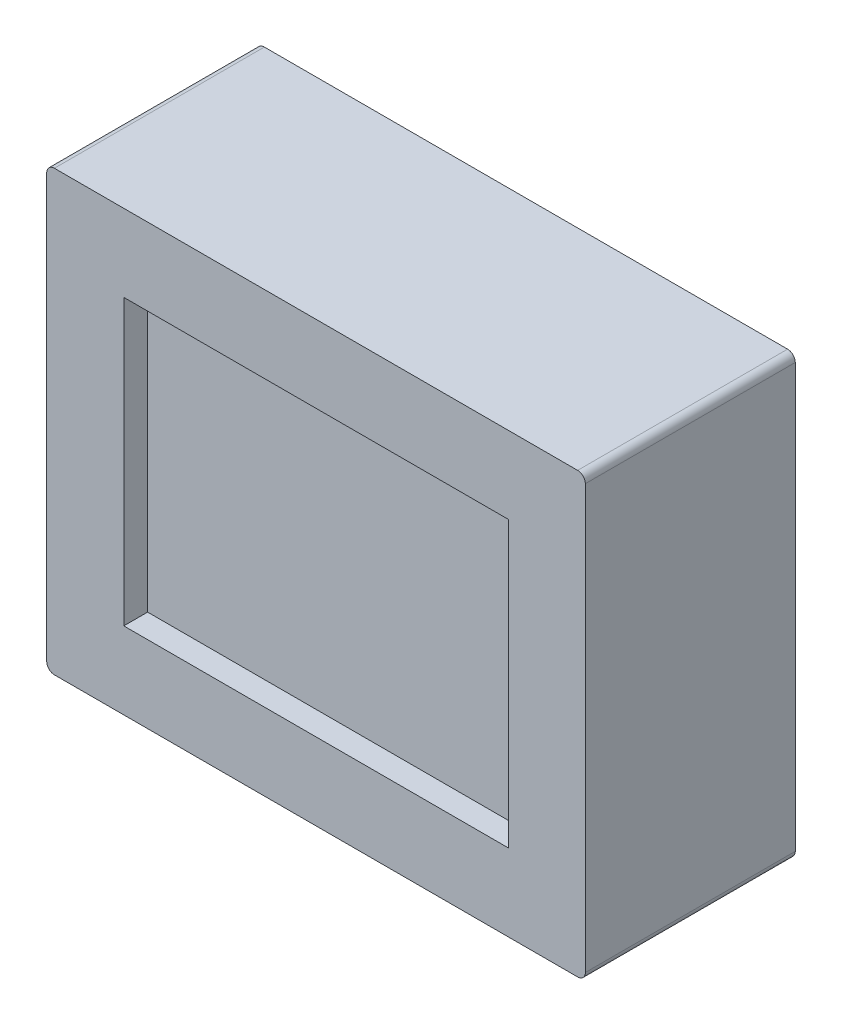
ISO-10303-21;
HEADER;
FILE_DESCRIPTION(('STEP AP214'),'2;1');
FILE_NAME('part.step','',(''),(''),'','','');
FILE_SCHEMA(('AUTOMOTIVE_DESIGN { 1 0 10303 214 1 1 1 1 }'));
ENDSEC;
DATA;
#1=APPLICATION_CONTEXT('core data for automotive mechanical design processes');
#2=APPLICATION_PROTOCOL_DEFINITION('international standard','automotive_design',2000,#1);
#3=PRODUCT_CONTEXT('',#1,'mechanical');
#4=PRODUCT('Part','Part','',(#3));
#5=PRODUCT_RELATED_PRODUCT_CATEGORY('part','',(#4));
#6=PRODUCT_DEFINITION_FORMATION('','',#4);
#7=PRODUCT_DEFINITION_CONTEXT('part definition',#1,'design');
#8=PRODUCT_DEFINITION('design','',#6,#7);
#9=PRODUCT_DEFINITION_SHAPE('','',#8);
#10=(LENGTH_UNIT() NAMED_UNIT(*) SI_UNIT(.MILLI.,.METRE.));
#11=(NAMED_UNIT(*) PLANE_ANGLE_UNIT() SI_UNIT($,.RADIAN.));
#12=(NAMED_UNIT(*) SI_UNIT($,.STERADIAN.) SOLID_ANGLE_UNIT());
#13=UNCERTAINTY_MEASURE_WITH_UNIT(LENGTH_MEASURE(1.E-05),#10,'distance_accuracy_value','');
#14=(GEOMETRIC_REPRESENTATION_CONTEXT(3) GLOBAL_UNCERTAINTY_ASSIGNED_CONTEXT((#13)) GLOBAL_UNIT_ASSIGNED_CONTEXT((#10,
#11,#12)) REPRESENTATION_CONTEXT('',''));
#15=CARTESIAN_POINT('',(0.,0.,0.));
#16=DIRECTION('',(0.,0.,1.));
#17=DIRECTION('',(1.,0.,0.));
#18=AXIS2_PLACEMENT_3D('',#15,#16,#17);
#19=CARTESIAN_POINT('',(35.02,28.525,27.3));
#20=DIRECTION('',(0.,-1.,0.));
#21=DIRECTION('',(0.,0.,-1.));
#22=AXIS2_PLACEMENT_3D('',#19,#20,#21);
#23=PLANE('',#22);
#24=DIRECTION('',(-1.,0.,0.));
#25=VECTOR('',#24,1.);
#26=CARTESIAN_POINT('',(35.02,28.525,0.));
#27=LINE('',#26,#25);
#28=CARTESIAN_POINT('',(34.02,28.525,0.));
#29=VERTEX_POINT('',#28);
#30=CARTESIAN_POINT('',(-34.02,28.525,0.));
#31=VERTEX_POINT('',#30);
#32=EDGE_CURVE('E212',#29,#31,#27,.T.);
#33=ORIENTED_EDGE('',*,*,#32,.T.);
#34=DIRECTION('',(0.,0.,-1.));
#35=VECTOR('',#34,1.);
#36=CARTESIAN_POINT('',(-34.02,28.525,27.3));
#37=LINE('',#36,#35);
#38=CARTESIAN_POINT('',(-34.02,28.525,27.3));
#39=VERTEX_POINT('',#38);
#40=EDGE_CURVE('E255',#31,#39,#37,.F.);
#41=ORIENTED_EDGE('',*,*,#40,.T.);
#42=DIRECTION('',(-1.,0.,0.));
#43=VECTOR('',#42,1.);
#44=CARTESIAN_POINT('',(35.02,28.525,27.3));
#45=LINE('',#44,#43);
#46=CARTESIAN_POINT('',(34.02,28.525,27.3));
#47=VERTEX_POINT('',#46);
#48=EDGE_CURVE('E216',#47,#39,#45,.T.);
#49=ORIENTED_EDGE('',*,*,#48,.F.);
#50=DIRECTION('',(0.,0.,-1.));
#51=VECTOR('',#50,1.);
#52=CARTESIAN_POINT('',(34.02,28.525,0.));
#53=LINE('',#52,#51);
#54=EDGE_CURVE('E252',#47,#29,#53,.T.);
#55=ORIENTED_EDGE('',*,*,#54,.T.);
#56=EDGE_LOOP('',(#33,#41,#49,#55));
#57=FACE_BOUND('',#56,.T.);
#58=ADVANCED_FACE('F34',(#57),#23,.F.);
#59=CARTESIAN_POINT('',(-35.02,28.525,27.3));
#60=DIRECTION('',(1.,0.,0.));
#61=DIRECTION('',(0.,1.,0.));
#62=AXIS2_PLACEMENT_3D('',#59,#60,#61);
#63=PLANE('',#62);
#64=DIRECTION('',(0.,-1.,0.));
#65=VECTOR('',#64,1.);
#66=CARTESIAN_POINT('',(-35.02,28.525,27.3));
#67=LINE('',#66,#65);
#68=CARTESIAN_POINT('',(-35.02,27.525,27.3));
#69=VERTEX_POINT('',#68);
#70=CARTESIAN_POINT('',(-35.02,-27.525,27.3));
#71=VERTEX_POINT('',#70);
#72=EDGE_CURVE('E219',#69,#71,#67,.T.);
#73=ORIENTED_EDGE('',*,*,#72,.F.);
#74=DIRECTION('',(0.,0.,-1.));
#75=VECTOR('',#74,1.);
#76=CARTESIAN_POINT('',(-35.02,27.525,27.3));
#77=LINE('',#76,#75);
#78=CARTESIAN_POINT('',(-35.02,27.525,0.));
#79=VERTEX_POINT('',#78);
#80=EDGE_CURVE('E241',#69,#79,#77,.T.);
#81=ORIENTED_EDGE('',*,*,#80,.T.);
#82=DIRECTION('',(0.,-1.,0.));
#83=VECTOR('',#82,1.);
#84=CARTESIAN_POINT('',(-35.02,28.525,0.));
#85=LINE('',#84,#83);
#86=CARTESIAN_POINT('',(-35.02,-27.525,0.));
#87=VERTEX_POINT('',#86);
#88=EDGE_CURVE('E232',#79,#87,#85,.T.);
#89=ORIENTED_EDGE('',*,*,#88,.T.);
#90=DIRECTION('',(0.,0.,-1.));
#91=VECTOR('',#90,1.);
#92=CARTESIAN_POINT('',(-35.02,-27.525,27.3));
#93=LINE('',#92,#91);
#94=EDGE_CURVE('E229',#87,#71,#93,.F.);
#95=ORIENTED_EDGE('',*,*,#94,.T.);
#96=EDGE_LOOP('',(#73,#81,#89,#95));
#97=FACE_BOUND('',#96,.T.);
#98=ADVANCED_FACE('F359',(#97),#63,.F.);
#99=CARTESIAN_POINT('',(35.02,-28.525,27.3));
#100=DIRECTION('',(0.,-1.,0.));
#101=DIRECTION('',(0.,0.,-1.));
#102=AXIS2_PLACEMENT_3D('',#99,#100,#101);
#103=PLANE('',#102);
#104=CARTESIAN_POINT('',(-18.,-28.525,4.1));
#105=DIRECTION('',(0.,-1.,0.));
#106=DIRECTION('',(0.,0.,-1.));
#107=AXIS2_PLACEMENT_3D('',#104,#105,#106);
#108=CIRCLE('',#107,2.);
#109=CARTESIAN_POINT('',(-18.,-28.525,2.1));
#110=VERTEX_POINT('',#109);
#111=CARTESIAN_POINT('',(-20.,-28.525,4.1));
#112=VERTEX_POINT('',#111);
#113=EDGE_CURVE('E43',#110,#112,#108,.F.);
#114=ORIENTED_EDGE('',*,*,#113,.T.);
#115=CARTESIAN_POINT('',(-18.,-28.525,4.1));
#116=DIRECTION('',(0.,-1.,0.));
#117=DIRECTION('',(0.,0.,-1.));
#118=AXIS2_PLACEMENT_3D('',#115,#116,#117);
#119=CIRCLE('',#118,2.);
#120=CARTESIAN_POINT('',(-18.,-28.525,6.1));
#121=VERTEX_POINT('',#120);
#122=EDGE_CURVE('E11',#112,#121,#119,.F.);
#123=ORIENTED_EDGE('',*,*,#122,.T.);
#124=CARTESIAN_POINT('',(-18.,-28.525,4.1));
#125=DIRECTION('',(0.,-1.,0.));
#126=DIRECTION('',(0.,0.,-1.));
#127=AXIS2_PLACEMENT_3D('',#124,#125,#126);
#128=CIRCLE('',#127,2.);
#129=CARTESIAN_POINT('',(-16.,-28.525,4.1));
#130=VERTEX_POINT('',#129);
#131=EDGE_CURVE('E304',#121,#130,#128,.F.);
#132=ORIENTED_EDGE('',*,*,#131,.T.);
#133=CARTESIAN_POINT('',(-18.,-28.525,4.1));
#134=DIRECTION('',(0.,-1.,0.));
#135=DIRECTION('',(0.,0.,-1.));
#136=AXIS2_PLACEMENT_3D('',#133,#134,#135);
#137=CIRCLE('',#136,2.);
#138=EDGE_CURVE('E302',#130,#110,#137,.F.);
#139=ORIENTED_EDGE('',*,*,#138,.T.);
#140=EDGE_LOOP('',(#114,#123,#132,#139));
#141=FACE_BOUND('',#140,.T.);
#142=CARTESIAN_POINT('',(18.,-28.525,4.1));
#143=DIRECTION('',(0.,-1.,0.));
#144=DIRECTION('',(0.,0.,-1.));
#145=AXIS2_PLACEMENT_3D('',#142,#143,#144);
#146=CIRCLE('',#145,2.);
#147=CARTESIAN_POINT('',(18.,-28.525,2.1));
#148=VERTEX_POINT('',#147);
#149=CARTESIAN_POINT('',(16.,-28.525,4.1));
#150=VERTEX_POINT('',#149);
#151=EDGE_CURVE('E298',#148,#150,#146,.F.);
#152=ORIENTED_EDGE('',*,*,#151,.T.);
#153=CARTESIAN_POINT('',(18.,-28.525,4.1));
#154=DIRECTION('',(0.,-1.,0.));
#155=DIRECTION('',(0.,0.,-1.));
#156=AXIS2_PLACEMENT_3D('',#153,#154,#155);
#157=CIRCLE('',#156,2.);
#158=CARTESIAN_POINT('',(18.,-28.525,6.1));
#159=VERTEX_POINT('',#158);
#160=EDGE_CURVE('E300',#150,#159,#157,.F.);
#161=ORIENTED_EDGE('',*,*,#160,.T.);
#162=CARTESIAN_POINT('',(18.,-28.525,4.1));
#163=DIRECTION('',(0.,-1.,0.));
#164=DIRECTION('',(0.,0.,-1.));
#165=AXIS2_PLACEMENT_3D('',#162,#163,#164);
#166=CIRCLE('',#165,2.);
#167=CARTESIAN_POINT('',(20.,-28.525,4.1));
#168=VERTEX_POINT('',#167);
#169=EDGE_CURVE('E296',#159,#168,#166,.F.);
#170=ORIENTED_EDGE('',*,*,#169,.T.);
#171=CARTESIAN_POINT('',(18.,-28.525,4.1));
#172=DIRECTION('',(0.,-1.,0.));
#173=DIRECTION('',(0.,0.,-1.));
#174=AXIS2_PLACEMENT_3D('',#171,#172,#173);
#175=CIRCLE('',#174,2.);
#176=EDGE_CURVE('E293',#168,#148,#175,.F.);
#177=ORIENTED_EDGE('',*,*,#176,.T.);
#178=EDGE_LOOP('',(#152,#161,#170,#177));
#179=FACE_BOUND('',#178,.T.);
#180=DIRECTION('',(-1.,0.,0.));
#181=VECTOR('',#180,1.);
#182=CARTESIAN_POINT('',(35.02,-28.525,0.));
#183=LINE('',#182,#181);
#184=CARTESIAN_POINT('',(34.02,-28.525,0.));
#185=VERTEX_POINT('',#184);
#186=CARTESIAN_POINT('',(-34.02,-28.525,0.));
#187=VERTEX_POINT('',#186);
#188=EDGE_CURVE('E235',#185,#187,#183,.T.);
#189=ORIENTED_EDGE('',*,*,#188,.F.);
#190=DIRECTION('',(0.,0.,-1.));
#191=VECTOR('',#190,1.);
#192=CARTESIAN_POINT('',(34.02,-28.525,27.3));
#193=LINE('',#192,#191);
#194=CARTESIAN_POINT('',(34.02,-28.525,27.3));
#195=VERTEX_POINT('',#194);
#196=EDGE_CURVE('E273',#185,#195,#193,.F.);
#197=ORIENTED_EDGE('',*,*,#196,.T.);
#198=DIRECTION('',(-1.,0.,0.));
#199=VECTOR('',#198,1.);
#200=CARTESIAN_POINT('',(35.02,-28.525,27.3));
#201=LINE('',#200,#199);
#202=CARTESIAN_POINT('',(-34.02,-28.525,27.3));
#203=VERTEX_POINT('',#202);
#204=EDGE_CURVE('E223',#195,#203,#201,.T.);
#205=ORIENTED_EDGE('',*,*,#204,.T.);
#206=DIRECTION('',(0.,0.,-1.));
#207=VECTOR('',#206,1.);
#208=CARTESIAN_POINT('',(-34.02,-28.525,0.));
#209=LINE('',#208,#207);
#210=EDGE_CURVE('E270',#203,#187,#209,.T.);
#211=ORIENTED_EDGE('',*,*,#210,.T.);
#212=EDGE_LOOP('',(#189,#197,#205,#211));
#213=FACE_BOUND('',#212,.T.);
#214=ADVANCED_FACE('F337',(#141,#179,#213),#103,.T.);
#215=CARTESIAN_POINT('',(35.02,28.525,27.3));
#216=DIRECTION('',(1.,0.,0.));
#217=DIRECTION('',(0.,0.,-1.));
#218=AXIS2_PLACEMENT_3D('',#215,#216,#217);
#219=PLANE('',#218);
#220=DIRECTION('',(0.,-1.,0.));
#221=VECTOR('',#220,1.);
#222=CARTESIAN_POINT('',(35.02,28.525,0.));
#223=LINE('',#222,#221);
#224=CARTESIAN_POINT('',(35.02,27.525,0.));
#225=VERTEX_POINT('',#224);
#226=CARTESIAN_POINT('',(35.02,-27.525,0.));
#227=VERTEX_POINT('',#226);
#228=EDGE_CURVE('E220',#225,#227,#223,.T.);
#229=ORIENTED_EDGE('',*,*,#228,.F.);
#230=DIRECTION('',(0.,0.,-1.));
#231=VECTOR('',#230,1.);
#232=CARTESIAN_POINT('',(35.02,27.525,27.3));
#233=LINE('',#232,#231);
#234=CARTESIAN_POINT('',(35.02,27.525,27.3));
#235=VERTEX_POINT('',#234);
#236=EDGE_CURVE('E268',#225,#235,#233,.F.);
#237=ORIENTED_EDGE('',*,*,#236,.T.);
#238=DIRECTION('',(0.,-1.,0.));
#239=VECTOR('',#238,1.);
#240=CARTESIAN_POINT('',(35.02,28.525,27.3));
#241=LINE('',#240,#239);
#242=CARTESIAN_POINT('',(35.02,-27.525,27.3));
#243=VERTEX_POINT('',#242);
#244=EDGE_CURVE('E226',#235,#243,#241,.T.);
#245=ORIENTED_EDGE('',*,*,#244,.T.);
#246=DIRECTION('',(0.,0.,-1.));
#247=VECTOR('',#246,1.);
#248=CARTESIAN_POINT('',(35.02,-27.525,27.3));
#249=LINE('',#248,#247);
#250=EDGE_CURVE('E265',#243,#227,#249,.T.);
#251=ORIENTED_EDGE('',*,*,#250,.T.);
#252=EDGE_LOOP('',(#229,#237,#245,#251));
#253=FACE_BOUND('',#252,.T.);
#254=ADVANCED_FACE('F558',(#253),#219,.T.);
#255=CARTESIAN_POINT('',(0.,0.,27.3));
#256=DIRECTION('',(0.,0.,1.));
#257=DIRECTION('',(1.,0.,0.));
#258=AXIS2_PLACEMENT_3D('',#255,#256,#257);
#259=PLANE('',#258);
#260=DIRECTION('',(0.,1.,0.));
#261=VECTOR('',#260,1.);
#262=CARTESIAN_POINT('',(25.,0.,27.3));
#263=LINE('',#262,#261);
#264=CARTESIAN_POINT('',(25.,-18.5,27.3));
#265=VERTEX_POINT('',#264);
#266=CARTESIAN_POINT('',(25.,18.5,27.3));
#267=VERTEX_POINT('',#266);
#268=EDGE_CURVE('E188',#265,#267,#263,.T.);
#269=ORIENTED_EDGE('',*,*,#268,.F.);
#270=DIRECTION('',(1.,0.,0.));
#271=VECTOR('',#270,1.);
#272=CARTESIAN_POINT('',(0.,-18.5,27.3));
#273=LINE('',#272,#271);
#274=CARTESIAN_POINT('',(-25.,-18.5,27.3));
#275=VERTEX_POINT('',#274);
#276=EDGE_CURVE('E193',#275,#265,#273,.T.);
#277=ORIENTED_EDGE('',*,*,#276,.F.);
#278=DIRECTION('',(0.,1.,0.));
#279=VECTOR('',#278,1.);
#280=CARTESIAN_POINT('',(-25.,0.,27.3));
#281=LINE('',#280,#279);
#282=CARTESIAN_POINT('',(-25.,18.5,27.3));
#283=VERTEX_POINT('',#282);
#284=EDGE_CURVE('E196',#275,#283,#281,.T.);
#285=ORIENTED_EDGE('',*,*,#284,.T.);
#286=DIRECTION('',(1.,0.,0.));
#287=VECTOR('',#286,1.);
#288=CARTESIAN_POINT('',(0.,18.5,27.3));
#289=LINE('',#288,#287);
#290=EDGE_CURVE('E205',#283,#267,#289,.T.);
#291=ORIENTED_EDGE('',*,*,#290,.T.);
#292=EDGE_LOOP('',(#269,#277,#285,#291));
#293=FACE_BOUND('',#292,.T.);
#294=ORIENTED_EDGE('',*,*,#48,.T.);
#295=CARTESIAN_POINT('',(-34.02,27.525,27.3));
#296=DIRECTION('',(0.,0.,1.));
#297=DIRECTION('',(1.,0.,0.));
#298=AXIS2_PLACEMENT_3D('',#295,#296,#297);
#299=CIRCLE('',#298,1.);
#300=EDGE_CURVE('E263',#39,#69,#299,.T.);
#301=ORIENTED_EDGE('',*,*,#300,.T.);
#302=ORIENTED_EDGE('',*,*,#72,.T.);
#303=CARTESIAN_POINT('',(-34.02,-27.525,27.3));
#304=DIRECTION('',(0.,0.,1.));
#305=DIRECTION('',(1.,0.,0.));
#306=AXIS2_PLACEMENT_3D('',#303,#304,#305);
#307=CIRCLE('',#306,1.);
#308=EDGE_CURVE('E257',#71,#203,#307,.T.);
#309=ORIENTED_EDGE('',*,*,#308,.T.);
#310=ORIENTED_EDGE('',*,*,#204,.F.);
#311=CARTESIAN_POINT('',(34.02,-27.525,27.3));
#312=DIRECTION('',(0.,0.,1.));
#313=DIRECTION('',(1.,0.,0.));
#314=AXIS2_PLACEMENT_3D('',#311,#312,#313);
#315=CIRCLE('',#314,1.);
#316=EDGE_CURVE('E259',#195,#243,#315,.T.);
#317=ORIENTED_EDGE('',*,*,#316,.T.);
#318=ORIENTED_EDGE('',*,*,#244,.F.);
#319=CARTESIAN_POINT('',(34.02,27.525,27.3));
#320=DIRECTION('',(0.,0.,1.));
#321=DIRECTION('',(1.,0.,0.));
#322=AXIS2_PLACEMENT_3D('',#319,#320,#321);
#323=CIRCLE('',#322,1.);
#324=EDGE_CURVE('E261',#235,#47,#323,.T.);
#325=ORIENTED_EDGE('',*,*,#324,.T.);
#326=EDGE_LOOP('',(#294,#301,#302,#309,#310,#317,#318,#325));
#327=FACE_BOUND('',#326,.T.);
#328=ADVANCED_FACE('F354',(#293,#327),#259,.T.);
#329=CARTESIAN_POINT('',(0.,0.,0.));
#330=DIRECTION('',(0.,0.,1.));
#331=DIRECTION('',(1.,0.,0.));
#332=AXIS2_PLACEMENT_3D('',#329,#330,#331);
#333=PLANE('',#332);
#334=CARTESIAN_POINT('',(-32.,25.5,0.));
#335=DIRECTION('',(0.,0.,1.));
#336=DIRECTION('',(1.,0.,0.));
#337=AXIS2_PLACEMENT_3D('',#334,#335,#336);
#338=CIRCLE('',#337,2.25);
#339=CARTESIAN_POINT('',(-29.75,25.5,0.));
#340=VERTEX_POINT('',#339);
#341=EDGE_CURVE('E317',#340,#340,#338,.T.);
#342=ORIENTED_EDGE('',*,*,#341,.T.);
#343=EDGE_LOOP('',(#342));
#344=FACE_BOUND('',#343,.T.);
#345=CARTESIAN_POINT('',(32.,25.5,0.));
#346=DIRECTION('',(0.,0.,1.));
#347=DIRECTION('',(1.,0.,0.));
#348=AXIS2_PLACEMENT_3D('',#345,#346,#347);
#349=CIRCLE('',#348,2.25000000000001);
#350=CARTESIAN_POINT('',(34.25,25.5,0.));
#351=VERTEX_POINT('',#350);
#352=EDGE_CURVE('E695',#351,#351,#349,.T.);
#353=ORIENTED_EDGE('',*,*,#352,.T.);
#354=EDGE_LOOP('',(#353));
#355=FACE_BOUND('',#354,.T.);
#356=CARTESIAN_POINT('',(32.,-25.5,0.));
#357=DIRECTION('',(0.,0.,1.));
#358=DIRECTION('',(1.,0.,0.));
#359=AXIS2_PLACEMENT_3D('',#356,#357,#358);
#360=CIRCLE('',#359,2.25000000000001);
#361=CARTESIAN_POINT('',(34.25,-25.5,0.));
#362=VERTEX_POINT('',#361);
#363=EDGE_CURVE('E688',#362,#362,#360,.T.);
#364=ORIENTED_EDGE('',*,*,#363,.T.);
#365=EDGE_LOOP('',(#364));
#366=FACE_BOUND('',#365,.T.);
#367=CARTESIAN_POINT('',(-32.,-25.5,0.));
#368=DIRECTION('',(0.,0.,1.));
#369=DIRECTION('',(1.,0.,0.));
#370=AXIS2_PLACEMENT_3D('',#367,#368,#369);
#371=CIRCLE('',#370,2.25);
#372=CARTESIAN_POINT('',(-29.75,-25.5,0.));
#373=VERTEX_POINT('',#372);
#374=EDGE_CURVE('E199',#373,#373,#371,.T.);
#375=ORIENTED_EDGE('',*,*,#374,.T.);
#376=EDGE_LOOP('',(#375));
#377=FACE_BOUND('',#376,.T.);
#378=ORIENTED_EDGE('',*,*,#88,.F.);
#379=CARTESIAN_POINT('',(-34.02,27.525,0.));
#380=DIRECTION('',(0.,0.,1.));
#381=DIRECTION('',(1.,0.,0.));
#382=AXIS2_PLACEMENT_3D('',#379,#380,#381);
#383=CIRCLE('',#382,1.);
#384=EDGE_CURVE('E250',#79,#31,#383,.F.);
#385=ORIENTED_EDGE('',*,*,#384,.T.);
#386=ORIENTED_EDGE('',*,*,#32,.F.);
#387=CARTESIAN_POINT('',(34.02,27.525,0.));
#388=DIRECTION('',(0.,0.,1.));
#389=DIRECTION('',(1.,0.,0.));
#390=AXIS2_PLACEMENT_3D('',#387,#388,#389);
#391=CIRCLE('',#390,1.);
#392=EDGE_CURVE('E248',#29,#225,#391,.F.);
#393=ORIENTED_EDGE('',*,*,#392,.T.);
#394=ORIENTED_EDGE('',*,*,#228,.T.);
#395=CARTESIAN_POINT('',(34.02,-27.525,0.));
#396=DIRECTION('',(0.,0.,1.));
#397=DIRECTION('',(1.,0.,0.));
#398=AXIS2_PLACEMENT_3D('',#395,#396,#397);
#399=CIRCLE('',#398,1.);
#400=EDGE_CURVE('E246',#227,#185,#399,.F.);
#401=ORIENTED_EDGE('',*,*,#400,.T.);
#402=ORIENTED_EDGE('',*,*,#188,.T.);
#403=CARTESIAN_POINT('',(-34.02,-27.525,0.));
#404=DIRECTION('',(0.,0.,1.));
#405=DIRECTION('',(1.,0.,0.));
#406=AXIS2_PLACEMENT_3D('',#403,#404,#405);
#407=CIRCLE('',#406,1.);
#408=EDGE_CURVE('E244',#187,#87,#407,.F.);
#409=ORIENTED_EDGE('',*,*,#408,.T.);
#410=EDGE_LOOP('',(#378,#385,#386,#393,#394,#401,#402,#409));
#411=FACE_BOUND('',#410,.T.);
#412=ADVANCED_FACE('F346',(#344,#355,#366,#377,#411),#333,.F.);
#413=CARTESIAN_POINT('',(0.,-38.525,6.1));
#414=DIRECTION('',(0.,1.,0.));
#415=DIRECTION('',(0.,0.,1.));
#416=AXIS2_PLACEMENT_3D('',#413,#414,#415);
#417=PLANE('',#416);
#418=CARTESIAN_POINT('',(-18.,-38.525,4.1));
#419=DIRECTION('',(0.,1.,0.));
#420=DIRECTION('',(0.,0.,1.));
#421=AXIS2_PLACEMENT_3D('',#418,#419,#420);
#422=CIRCLE('',#421,2.);
#423=CARTESIAN_POINT('',(-20.,-38.525,4.1));
#424=VERTEX_POINT('',#423);
#425=CARTESIAN_POINT('',(-18.,-38.525,2.1));
#426=VERTEX_POINT('',#425);
#427=EDGE_CURVE('E286',#424,#426,#422,.F.);
#428=ORIENTED_EDGE('',*,*,#427,.T.);
#429=CARTESIAN_POINT('',(-18.,-38.525,4.1));
#430=DIRECTION('',(0.,1.,0.));
#431=DIRECTION('',(0.,0.,1.));
#432=AXIS2_PLACEMENT_3D('',#429,#430,#431);
#433=CIRCLE('',#432,2.);
#434=CARTESIAN_POINT('',(-16.,-38.525,4.1));
#435=VERTEX_POINT('',#434);
#436=EDGE_CURVE('E290',#426,#435,#433,.F.);
#437=ORIENTED_EDGE('',*,*,#436,.T.);
#438=CARTESIAN_POINT('',(-18.,-38.525,4.1));
#439=DIRECTION('',(0.,1.,0.));
#440=DIRECTION('',(0.,0.,1.));
#441=AXIS2_PLACEMENT_3D('',#438,#439,#440);
#442=CIRCLE('',#441,2.);
#443=CARTESIAN_POINT('',(-18.,-38.525,6.1));
#444=VERTEX_POINT('',#443);
#445=EDGE_CURVE('E288',#435,#444,#442,.F.);
#446=ORIENTED_EDGE('',*,*,#445,.T.);
#447=CARTESIAN_POINT('',(-18.,-38.525,4.1));
#448=DIRECTION('',(0.,1.,0.));
#449=DIRECTION('',(0.,0.,1.));
#450=AXIS2_PLACEMENT_3D('',#447,#448,#449);
#451=CIRCLE('',#450,2.);
#452=EDGE_CURVE('E284',#444,#424,#451,.F.);
#453=ORIENTED_EDGE('',*,*,#452,.T.);
#454=EDGE_LOOP('',(#428,#437,#446,#453));
#455=FACE_BOUND('',#454,.T.);
#456=ADVANCED_FACE('F343',(#455),#417,.F.);
#457=CARTESIAN_POINT('',(0.,-38.5250000000001,6.1));
#458=DIRECTION('',(0.,-1.,0.));
#459=DIRECTION('',(1.,0.,0.));
#460=AXIS2_PLACEMENT_3D('',#457,#458,#459);
#461=PLANE('',#460);
#462=CARTESIAN_POINT('',(18.,-38.525,4.1));
#463=DIRECTION('',(0.,-1.,0.));
#464=DIRECTION('',(1.,0.,0.));
#465=AXIS2_PLACEMENT_3D('',#462,#463,#464);
#466=CIRCLE('',#465,2.);
#467=CARTESIAN_POINT('',(16.,-38.525,4.1));
#468=VERTEX_POINT('',#467);
#469=CARTESIAN_POINT('',(18.,-38.525,2.1));
#470=VERTEX_POINT('',#469);
#471=EDGE_CURVE('E277',#468,#470,#466,.T.);
#472=ORIENTED_EDGE('',*,*,#471,.T.);
#473=CARTESIAN_POINT('',(18.,-38.525,4.1));
#474=DIRECTION('',(0.,-1.,0.));
#475=DIRECTION('',(1.,0.,0.));
#476=AXIS2_PLACEMENT_3D('',#473,#474,#475);
#477=CIRCLE('',#476,2.);
#478=CARTESIAN_POINT('',(20.,-38.525,4.1));
#479=VERTEX_POINT('',#478);
#480=EDGE_CURVE('E281',#470,#479,#477,.T.);
#481=ORIENTED_EDGE('',*,*,#480,.T.);
#482=CARTESIAN_POINT('',(18.,-38.525,4.1));
#483=DIRECTION('',(0.,-1.,0.));
#484=DIRECTION('',(1.,0.,0.));
#485=AXIS2_PLACEMENT_3D('',#482,#483,#484);
#486=CIRCLE('',#485,2.);
#487=CARTESIAN_POINT('',(18.,-38.525,6.1));
#488=VERTEX_POINT('',#487);
#489=EDGE_CURVE('E279',#479,#488,#486,.T.);
#490=ORIENTED_EDGE('',*,*,#489,.T.);
#491=CARTESIAN_POINT('',(18.,-38.525,4.1));
#492=DIRECTION('',(0.,-1.,0.));
#493=DIRECTION('',(1.,0.,0.));
#494=AXIS2_PLACEMENT_3D('',#491,#492,#493);
#495=CIRCLE('',#494,2.);
#496=EDGE_CURVE('E275',#488,#468,#495,.T.);
#497=ORIENTED_EDGE('',*,*,#496,.T.);
#498=EDGE_LOOP('',(#472,#481,#490,#497));
#499=FACE_BOUND('',#498,.T.);
#500=ADVANCED_FACE('F345',(#499),#461,.T.);
#501=CARTESIAN_POINT('',(25.,0.,24.2));
#502=DIRECTION('',(1.,0.,0.));
#503=DIRECTION('',(0.,1.,0.));
#504=AXIS2_PLACEMENT_3D('',#501,#502,#503);
#505=PLANE('',#504);
#506=ORIENTED_EDGE('',*,*,#268,.T.);
#507=DIRECTION('',(0.,0.,1.));
#508=VECTOR('',#507,1.);
#509=CARTESIAN_POINT('',(25.,18.5,24.2));
#510=LINE('',#509,#508);
#511=CARTESIAN_POINT('',(25.,18.5,24.2));
#512=VERTEX_POINT('',#511);
#513=EDGE_CURVE('E174',#512,#267,#510,.T.);
#514=ORIENTED_EDGE('',*,*,#513,.F.);
#515=DIRECTION('',(0.,1.,0.));
#516=VECTOR('',#515,1.);
#517=CARTESIAN_POINT('',(25.,0.,24.2));
#518=LINE('',#517,#516);
#519=CARTESIAN_POINT('',(25.,-18.5,24.2));
#520=VERTEX_POINT('',#519);
#521=EDGE_CURVE('E181',#520,#512,#518,.T.);
#522=ORIENTED_EDGE('',*,*,#521,.F.);
#523=DIRECTION('',(0.,0.,1.));
#524=VECTOR('',#523,1.);
#525=CARTESIAN_POINT('',(25.,-18.5,24.2));
#526=LINE('',#525,#524);
#527=EDGE_CURVE('E210',#520,#265,#526,.T.);
#528=ORIENTED_EDGE('',*,*,#527,.T.);
#529=EDGE_LOOP('',(#506,#514,#522,#528));
#530=FACE_BOUND('',#529,.T.);
#531=ADVANCED_FACE('F185',(#530),#505,.F.);
#532=CARTESIAN_POINT('',(0.,-18.5,24.2));
#533=DIRECTION('',(0.,-1.,0.));
#534=DIRECTION('',(1.,0.,0.));
#535=AXIS2_PLACEMENT_3D('',#532,#533,#534);
#536=PLANE('',#535);
#537=ORIENTED_EDGE('',*,*,#276,.T.);
#538=ORIENTED_EDGE('',*,*,#527,.F.);
#539=DIRECTION('',(1.,0.,0.));
#540=VECTOR('',#539,1.);
#541=CARTESIAN_POINT('',(0.,-18.5,24.2));
#542=LINE('',#541,#540);
#543=CARTESIAN_POINT('',(-25.,-18.5,24.2));
#544=VERTEX_POINT('',#543);
#545=EDGE_CURVE('E189',#544,#520,#542,.T.);
#546=ORIENTED_EDGE('',*,*,#545,.F.);
#547=DIRECTION('',(0.,0.,1.));
#548=VECTOR('',#547,1.);
#549=CARTESIAN_POINT('',(-25.,-18.5,24.2));
#550=LINE('',#549,#548);
#551=EDGE_CURVE('E213',#544,#275,#550,.T.);
#552=ORIENTED_EDGE('',*,*,#551,.T.);
#553=EDGE_LOOP('',(#537,#538,#546,#552));
#554=FACE_BOUND('',#553,.T.);
#555=ADVANCED_FACE('F528',(#554),#536,.F.);
#556=CARTESIAN_POINT('',(-25.,0.,24.2));
#557=DIRECTION('',(1.,0.,0.));
#558=DIRECTION('',(0.,1.,0.));
#559=AXIS2_PLACEMENT_3D('',#556,#557,#558);
#560=PLANE('',#559);
#561=ORIENTED_EDGE('',*,*,#284,.F.);
#562=ORIENTED_EDGE('',*,*,#551,.F.);
#563=DIRECTION('',(0.,1.,0.));
#564=VECTOR('',#563,1.);
#565=CARTESIAN_POINT('',(-25.,0.,24.2));
#566=LINE('',#565,#564);
#567=CARTESIAN_POINT('',(-25.,18.5,24.2));
#568=VERTEX_POINT('',#567);
#569=EDGE_CURVE('E180',#544,#568,#566,.T.);
#570=ORIENTED_EDGE('',*,*,#569,.T.);
#571=DIRECTION('',(0.,0.,1.));
#572=VECTOR('',#571,1.);
#573=CARTESIAN_POINT('',(-25.,18.5,24.2));
#574=LINE('',#573,#572);
#575=EDGE_CURVE('E176',#568,#283,#574,.T.);
#576=ORIENTED_EDGE('',*,*,#575,.T.);
#577=EDGE_LOOP('',(#561,#562,#570,#576));
#578=FACE_BOUND('',#577,.T.);
#579=ADVANCED_FACE('F521',(#578),#560,.T.);
#580=CARTESIAN_POINT('',(0.,18.5,24.2));
#581=DIRECTION('',(0.,-1.,0.));
#582=DIRECTION('',(1.,0.,0.));
#583=AXIS2_PLACEMENT_3D('',#580,#581,#582);
#584=PLANE('',#583);
#585=ORIENTED_EDGE('',*,*,#290,.F.);
#586=ORIENTED_EDGE('',*,*,#575,.F.);
#587=DIRECTION('',(1.,0.,0.));
#588=VECTOR('',#587,1.);
#589=CARTESIAN_POINT('',(0.,18.5,24.2));
#590=LINE('',#589,#588);
#591=EDGE_CURVE('E170',#568,#512,#590,.T.);
#592=ORIENTED_EDGE('',*,*,#591,.T.);
#593=ORIENTED_EDGE('',*,*,#513,.T.);
#594=EDGE_LOOP('',(#585,#586,#592,#593));
#595=FACE_BOUND('',#594,.T.);
#596=ADVANCED_FACE('F173',(#595),#584,.T.);
#597=CARTESIAN_POINT('',(0.,0.,24.2));
#598=DIRECTION('',(0.,0.,-1.));
#599=DIRECTION('',(-1.,0.,0.));
#600=AXIS2_PLACEMENT_3D('',#597,#598,#599);
#601=PLANE('',#600);
#602=ORIENTED_EDGE('',*,*,#521,.T.);
#603=ORIENTED_EDGE('',*,*,#591,.F.);
#604=ORIENTED_EDGE('',*,*,#569,.F.);
#605=ORIENTED_EDGE('',*,*,#545,.T.);
#606=EDGE_LOOP('',(#602,#603,#604,#605));
#607=FACE_BOUND('',#606,.T.);
#608=ADVANCED_FACE('F191',(#607),#601,.F.);
#609=CARTESIAN_POINT('',(-32.,-25.5,-0.3));
#610=DIRECTION('',(0.,0.,1.));
#611=DIRECTION('',(1.,0.,0.));
#612=AXIS2_PLACEMENT_3D('',#609,#610,#611);
#613=CYLINDRICAL_SURFACE('',#612,2.25);
#614=CARTESIAN_POINT('',(-32.,-25.5,-0.3));
#615=DIRECTION('',(0.,0.,1.));
#616=DIRECTION('',(1.,0.,0.));
#617=AXIS2_PLACEMENT_3D('',#614,#615,#616);
#618=CIRCLE('',#617,2.25);
#619=CARTESIAN_POINT('',(-29.75,-25.5,-0.3));
#620=VERTEX_POINT('',#619);
#621=EDGE_CURVE('E206',#620,#620,#618,.T.);
#622=ORIENTED_EDGE('',*,*,#621,.T.);
#623=EDGE_LOOP('',(#622));
#624=FACE_BOUND('',#623,.T.);
#625=ORIENTED_EDGE('',*,*,#374,.F.);
#626=EDGE_LOOP('',(#625));
#627=FACE_BOUND('',#626,.T.);
#628=ADVANCED_FACE('F500',(#624,#627),#613,.T.);
#629=CARTESIAN_POINT('',(0.,0.,-0.3));
#630=DIRECTION('',(0.,0.,1.));
#631=DIRECTION('',(1.,0.,0.));
#632=AXIS2_PLACEMENT_3D('',#629,#630,#631);
#633=PLANE('',#632);
#634=ORIENTED_EDGE('',*,*,#621,.F.);
#635=EDGE_LOOP('',(#634));
#636=FACE_BOUND('',#635,.T.);
#637=ADVANCED_FACE('F492',(#636),#633,.F.);
#638=CARTESIAN_POINT('',(32.,-25.5,-0.3));
#639=DIRECTION('',(0.,0.,1.));
#640=DIRECTION('',(1.,0.,0.));
#641=AXIS2_PLACEMENT_3D('',#638,#639,#640);
#642=CYLINDRICAL_SURFACE('',#641,2.25000000000001);
#643=CARTESIAN_POINT('',(32.,-25.5,-0.3));
#644=DIRECTION('',(0.,0.,1.));
#645=DIRECTION('',(1.,0.,0.));
#646=AXIS2_PLACEMENT_3D('',#643,#644,#645);
#647=CIRCLE('',#646,2.25000000000001);
#648=CARTESIAN_POINT('',(34.25,-25.5,-0.3));
#649=VERTEX_POINT('',#648);
#650=EDGE_CURVE('E686',#649,#649,#647,.T.);
#651=ORIENTED_EDGE('',*,*,#650,.T.);
#652=EDGE_LOOP('',(#651));
#653=FACE_BOUND('',#652,.T.);
#654=ORIENTED_EDGE('',*,*,#363,.F.);
#655=EDGE_LOOP('',(#654));
#656=FACE_BOUND('',#655,.T.);
#657=ADVANCED_FACE('F484',(#653,#656),#642,.T.);
#658=CARTESIAN_POINT('',(0.,0.,-0.3));
#659=DIRECTION('',(0.,0.,1.));
#660=DIRECTION('',(1.,0.,0.));
#661=AXIS2_PLACEMENT_3D('',#658,#659,#660);
#662=PLANE('',#661);
#663=ORIENTED_EDGE('',*,*,#650,.F.);
#664=EDGE_LOOP('',(#663));
#665=FACE_BOUND('',#664,.T.);
#666=ADVANCED_FACE('F476',(#665),#662,.F.);
#667=CARTESIAN_POINT('',(32.,25.5,-0.3));
#668=DIRECTION('',(0.,0.,1.));
#669=DIRECTION('',(1.,0.,0.));
#670=AXIS2_PLACEMENT_3D('',#667,#668,#669);
#671=CYLINDRICAL_SURFACE('',#670,2.25000000000001);
#672=CARTESIAN_POINT('',(32.,25.5,-0.3));
#673=DIRECTION('',(0.,0.,1.));
#674=DIRECTION('',(1.,0.,0.));
#675=AXIS2_PLACEMENT_3D('',#672,#673,#674);
#676=CIRCLE('',#675,2.25000000000001);
#677=CARTESIAN_POINT('',(34.25,25.5,-0.3));
#678=VERTEX_POINT('',#677);
#679=EDGE_CURVE('E692',#678,#678,#676,.T.);
#680=ORIENTED_EDGE('',*,*,#679,.T.);
#681=EDGE_LOOP('',(#680));
#682=FACE_BOUND('',#681,.T.);
#683=ORIENTED_EDGE('',*,*,#352,.F.);
#684=EDGE_LOOP('',(#683));
#685=FACE_BOUND('',#684,.T.);
#686=ADVANCED_FACE('F468',(#682,#685),#671,.T.);
#687=CARTESIAN_POINT('',(0.,0.,-0.3));
#688=DIRECTION('',(0.,0.,1.));
#689=DIRECTION('',(1.,0.,0.));
#690=AXIS2_PLACEMENT_3D('',#687,#688,#689);
#691=PLANE('',#690);
#692=ORIENTED_EDGE('',*,*,#679,.F.);
#693=EDGE_LOOP('',(#692));
#694=FACE_BOUND('',#693,.T.);
#695=ADVANCED_FACE('F460',(#694),#691,.F.);
#696=CARTESIAN_POINT('',(-32.,25.5,-0.3));
#697=DIRECTION('',(0.,0.,1.));
#698=DIRECTION('',(1.,0.,0.));
#699=AXIS2_PLACEMENT_3D('',#696,#697,#698);
#700=CYLINDRICAL_SURFACE('',#699,2.25);
#701=CARTESIAN_POINT('',(-32.,25.5,-0.3));
#702=DIRECTION('',(0.,0.,1.));
#703=DIRECTION('',(1.,0.,0.));
#704=AXIS2_PLACEMENT_3D('',#701,#702,#703);
#705=CIRCLE('',#704,2.25);
#706=CARTESIAN_POINT('',(-29.75,25.5,-0.3));
#707=VERTEX_POINT('',#706);
#708=EDGE_CURVE('E698',#707,#707,#705,.T.);
#709=ORIENTED_EDGE('',*,*,#708,.T.);
#710=EDGE_LOOP('',(#709));
#711=FACE_BOUND('',#710,.T.);
#712=ORIENTED_EDGE('',*,*,#341,.F.);
#713=EDGE_LOOP('',(#712));
#714=FACE_BOUND('',#713,.T.);
#715=ADVANCED_FACE('F452',(#711,#714),#700,.T.);
#716=CARTESIAN_POINT('',(0.,0.,-0.3));
#717=DIRECTION('',(0.,0.,1.));
#718=DIRECTION('',(1.,0.,0.));
#719=AXIS2_PLACEMENT_3D('',#716,#717,#718);
#720=PLANE('',#719);
#721=ORIENTED_EDGE('',*,*,#708,.F.);
#722=EDGE_LOOP('',(#721));
#723=FACE_BOUND('',#722,.T.);
#724=ADVANCED_FACE('F373',(#723),#720,.F.);
#725=CARTESIAN_POINT('',(-34.02,27.525,27.3));
#726=DIRECTION('',(0.,0.,-1.));
#727=DIRECTION('',(-1.,0.,0.));
#728=AXIS2_PLACEMENT_3D('',#725,#726,#727);
#729=CYLINDRICAL_SURFACE('',#728,1.);
#730=ORIENTED_EDGE('',*,*,#300,.F.);
#731=ORIENTED_EDGE('',*,*,#40,.F.);
#732=ORIENTED_EDGE('',*,*,#384,.F.);
#733=ORIENTED_EDGE('',*,*,#80,.F.);
#734=EDGE_LOOP('',(#730,#731,#732,#733));
#735=FACE_BOUND('',#734,.T.);
#736=ADVANCED_FACE('F369',(#735),#729,.T.);
#737=CARTESIAN_POINT('',(34.02,27.525,27.3));
#738=DIRECTION('',(0.,0.,1.));
#739=DIRECTION('',(1.,0.,0.));
#740=AXIS2_PLACEMENT_3D('',#737,#738,#739);
#741=CYLINDRICAL_SURFACE('',#740,1.);
#742=ORIENTED_EDGE('',*,*,#324,.F.);
#743=ORIENTED_EDGE('',*,*,#236,.F.);
#744=ORIENTED_EDGE('',*,*,#392,.F.);
#745=ORIENTED_EDGE('',*,*,#54,.F.);
#746=EDGE_LOOP('',(#742,#743,#744,#745));
#747=FACE_BOUND('',#746,.T.);
#748=ADVANCED_FACE('F372',(#747),#741,.T.);
#749=CARTESIAN_POINT('',(34.02,-27.525,27.3));
#750=DIRECTION('',(0.,0.,-1.));
#751=DIRECTION('',(-1.,0.,0.));
#752=AXIS2_PLACEMENT_3D('',#749,#750,#751);
#753=CYLINDRICAL_SURFACE('',#752,1.);
#754=ORIENTED_EDGE('',*,*,#316,.F.);
#755=ORIENTED_EDGE('',*,*,#196,.F.);
#756=ORIENTED_EDGE('',*,*,#400,.F.);
#757=ORIENTED_EDGE('',*,*,#250,.F.);
#758=EDGE_LOOP('',(#754,#755,#756,#757));
#759=FACE_BOUND('',#758,.T.);
#760=ADVANCED_FACE('F377',(#759),#753,.T.);
#761=CARTESIAN_POINT('',(-34.02,-27.525,27.3));
#762=DIRECTION('',(0.,0.,1.));
#763=DIRECTION('',(1.,0.,0.));
#764=AXIS2_PLACEMENT_3D('',#761,#762,#763);
#765=CYLINDRICAL_SURFACE('',#764,1.);
#766=ORIENTED_EDGE('',*,*,#308,.F.);
#767=ORIENTED_EDGE('',*,*,#94,.F.);
#768=ORIENTED_EDGE('',*,*,#408,.F.);
#769=ORIENTED_EDGE('',*,*,#210,.F.);
#770=EDGE_LOOP('',(#766,#767,#768,#769));
#771=FACE_BOUND('',#770,.T.);
#772=ADVANCED_FACE('F381',(#771),#765,.T.);
#773=CARTESIAN_POINT('',(18.,0.,4.1));
#774=DIRECTION('',(0.,1.,0.));
#775=DIRECTION('',(0.,0.,1.));
#776=AXIS2_PLACEMENT_3D('',#773,#774,#775);
#777=CYLINDRICAL_SURFACE('',#776,2.);
#778=DIRECTION('',(0.,1.,0.));
#779=VECTOR('',#778,1.);
#780=CARTESIAN_POINT('',(16.,0.,4.1));
#781=LINE('',#780,#779);
#782=EDGE_CURVE('E311',#468,#150,#781,.T.);
#783=ORIENTED_EDGE('',*,*,#782,.F.);
#784=ORIENTED_EDGE('',*,*,#496,.F.);
#785=DIRECTION('',(0.,1.,0.));
#786=VECTOR('',#785,1.);
#787=CARTESIAN_POINT('',(18.,0.,6.1));
#788=LINE('',#787,#786);
#789=EDGE_CURVE('E314',#159,#488,#788,.F.);
#790=ORIENTED_EDGE('',*,*,#789,.F.);
#791=ORIENTED_EDGE('',*,*,#160,.F.);
#792=EDGE_LOOP('',(#783,#784,#790,#791));
#793=FACE_BOUND('',#792,.T.);
#794=ADVANCED_FACE('F385',(#793),#777,.T.);
#795=CARTESIAN_POINT('',(18.,0.,4.1));
#796=DIRECTION('',(0.,-1.,0.));
#797=DIRECTION('',(0.,0.,-1.));
#798=AXIS2_PLACEMENT_3D('',#795,#796,#797);
#799=CYLINDRICAL_SURFACE('',#798,2.);
#800=ORIENTED_EDGE('',*,*,#789,.T.);
#801=ORIENTED_EDGE('',*,*,#489,.F.);
#802=DIRECTION('',(0.,-1.,0.));
#803=VECTOR('',#802,1.);
#804=CARTESIAN_POINT('',(20.,0.,4.1));
#805=LINE('',#804,#803);
#806=EDGE_CURVE('E309',#168,#479,#805,.T.);
#807=ORIENTED_EDGE('',*,*,#806,.F.);
#808=ORIENTED_EDGE('',*,*,#169,.F.);
#809=EDGE_LOOP('',(#800,#801,#807,#808));
#810=FACE_BOUND('',#809,.T.);
#811=ADVANCED_FACE('F394',(#810),#799,.T.);
#812=CARTESIAN_POINT('',(18.,0.,4.1));
#813=DIRECTION('',(0.,-1.,0.));
#814=DIRECTION('',(0.,0.,-1.));
#815=AXIS2_PLACEMENT_3D('',#812,#813,#814);
#816=CYLINDRICAL_SURFACE('',#815,2.);
#817=ORIENTED_EDGE('',*,*,#782,.T.);
#818=ORIENTED_EDGE('',*,*,#151,.F.);
#819=DIRECTION('',(0.,1.,0.));
#820=VECTOR('',#819,1.);
#821=CARTESIAN_POINT('',(18.,-28.525,2.1));
#822=LINE('',#821,#820);
#823=EDGE_CURVE('E307',#470,#148,#822,.T.);
#824=ORIENTED_EDGE('',*,*,#823,.F.);
#825=ORIENTED_EDGE('',*,*,#471,.F.);
#826=EDGE_LOOP('',(#817,#818,#824,#825));
#827=FACE_BOUND('',#826,.T.);
#828=ADVANCED_FACE('F390',(#827),#816,.T.);
#829=CARTESIAN_POINT('',(18.,0.,4.1));
#830=DIRECTION('',(0.,1.,0.));
#831=DIRECTION('',(0.,0.,1.));
#832=AXIS2_PLACEMENT_3D('',#829,#830,#831);
#833=CYLINDRICAL_SURFACE('',#832,2.);
#834=ORIENTED_EDGE('',*,*,#176,.F.);
#835=ORIENTED_EDGE('',*,*,#806,.T.);
#836=ORIENTED_EDGE('',*,*,#480,.F.);
#837=ORIENTED_EDGE('',*,*,#823,.T.);
#838=EDGE_LOOP('',(#834,#835,#836,#837));
#839=FACE_BOUND('',#838,.T.);
#840=ADVANCED_FACE('F387',(#839),#833,.T.);
#841=CARTESIAN_POINT('',(-18.,0.,4.1));
#842=DIRECTION('',(0.,1.,0.));
#843=DIRECTION('',(0.,0.,1.));
#844=AXIS2_PLACEMENT_3D('',#841,#842,#843);
#845=CYLINDRICAL_SURFACE('',#844,2.);
#846=DIRECTION('',(0.,-1.,0.));
#847=VECTOR('',#846,1.);
#848=CARTESIAN_POINT('',(-18.,-38.525,6.1));
#849=LINE('',#848,#847);
#850=EDGE_CURVE('E321',#121,#444,#849,.T.);
#851=ORIENTED_EDGE('',*,*,#850,.F.);
#852=ORIENTED_EDGE('',*,*,#122,.F.);
#853=DIRECTION('',(0.,-1.,0.));
#854=VECTOR('',#853,1.);
#855=CARTESIAN_POINT('',(-20.,-28.525,4.1));
#856=LINE('',#855,#854);
#857=EDGE_CURVE('E38',#424,#112,#856,.F.);
#858=ORIENTED_EDGE('',*,*,#857,.F.);
#859=ORIENTED_EDGE('',*,*,#452,.F.);
#860=EDGE_LOOP('',(#851,#852,#858,#859));
#861=FACE_BOUND('',#860,.T.);
#862=ADVANCED_FACE('F36',(#861),#845,.T.);
#863=CARTESIAN_POINT('',(-18.,0.,4.1));
#864=DIRECTION('',(0.,-1.,0.));
#865=DIRECTION('',(0.,0.,-1.));
#866=AXIS2_PLACEMENT_3D('',#863,#864,#865);
#867=CYLINDRICAL_SURFACE('',#866,2.);
#868=ORIENTED_EDGE('',*,*,#857,.T.);
#869=ORIENTED_EDGE('',*,*,#113,.F.);
#870=DIRECTION('',(0.,-1.,0.));
#871=VECTOR('',#870,1.);
#872=CARTESIAN_POINT('',(-18.,0.,2.1));
#873=LINE('',#872,#871);
#874=EDGE_CURVE('E320',#426,#110,#873,.F.);
#875=ORIENTED_EDGE('',*,*,#874,.F.);
#876=ORIENTED_EDGE('',*,*,#427,.F.);
#877=EDGE_LOOP('',(#868,#869,#875,#876));
#878=FACE_BOUND('',#877,.T.);
#879=ADVANCED_FACE('F330',(#878),#867,.T.);
#880=CARTESIAN_POINT('',(-18.,0.,4.1));
#881=DIRECTION('',(0.,-1.,0.));
#882=DIRECTION('',(1.,0.,0.));
#883=AXIS2_PLACEMENT_3D('',#880,#881,#882);
#884=CYLINDRICAL_SURFACE('',#883,2.);
#885=ORIENTED_EDGE('',*,*,#850,.T.);
#886=ORIENTED_EDGE('',*,*,#445,.F.);
#887=DIRECTION('',(0.,1.,0.));
#888=VECTOR('',#887,1.);
#889=CARTESIAN_POINT('',(-16.,-38.525,4.1));
#890=LINE('',#889,#888);
#891=EDGE_CURVE('E318',#130,#435,#890,.F.);
#892=ORIENTED_EDGE('',*,*,#891,.F.);
#893=ORIENTED_EDGE('',*,*,#131,.F.);
#894=EDGE_LOOP('',(#885,#886,#892,#893));
#895=FACE_BOUND('',#894,.T.);
#896=ADVANCED_FACE('F335',(#895),#884,.T.);
#897=CARTESIAN_POINT('',(-18.,0.,4.1));
#898=DIRECTION('',(0.,1.,0.));
#899=DIRECTION('',(-1.,0.,0.));
#900=AXIS2_PLACEMENT_3D('',#897,#898,#899);
#901=CYLINDRICAL_SURFACE('',#900,2.);
#902=ORIENTED_EDGE('',*,*,#436,.F.);
#903=ORIENTED_EDGE('',*,*,#874,.T.);
#904=ORIENTED_EDGE('',*,*,#138,.F.);
#905=ORIENTED_EDGE('',*,*,#891,.T.);
#906=EDGE_LOOP('',(#902,#903,#904,#905));
#907=FACE_BOUND('',#906,.T.);
#908=ADVANCED_FACE('F341',(#907),#901,.T.);
#909=CLOSED_SHELL('',(#58,#98,#214,#254,#328,#412,#456,#500,#531,#555,#579,#596,#608,#628,#637,
#657,#666,#686,#695,#715,#724,#736,#748,#760,#772,#794,#811,#828,#840,#862,#879,#896,#908));
#910=MANIFOLD_SOLID_BREP('B2',#909);
#911=ADVANCED_BREP_SHAPE_REPRESENTATION('',(#18,#910),#14);
#912=SHAPE_DEFINITION_REPRESENTATION(#9,#911);
ENDSEC;
END-ISO-10303-21;
